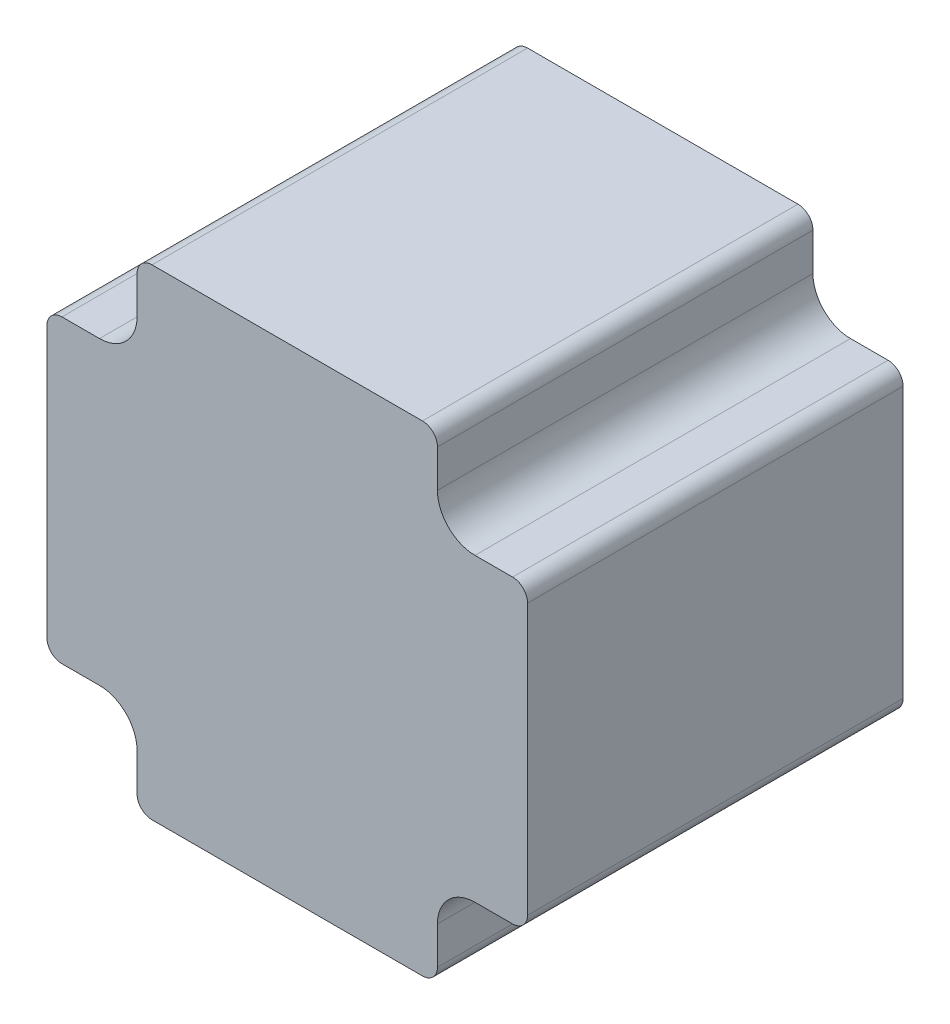
ISO-10303-21;
HEADER;
FILE_DESCRIPTION(('STEP AP214'),'2;1');
FILE_NAME('part.step','',(''),(''),'','','');
FILE_SCHEMA(('AUTOMOTIVE_DESIGN { 1 0 10303 214 1 1 1 1 }'));
ENDSEC;
DATA;
#1=APPLICATION_CONTEXT('core data for automotive mechanical design processes');
#2=APPLICATION_PROTOCOL_DEFINITION('international standard','automotive_design',2000,#1);
#3=PRODUCT_CONTEXT('',#1,'mechanical');
#4=PRODUCT('Part','Part','',(#3));
#5=PRODUCT_RELATED_PRODUCT_CATEGORY('part','',(#4));
#6=PRODUCT_DEFINITION_FORMATION('','',#4);
#7=PRODUCT_DEFINITION_CONTEXT('part definition',#1,'design');
#8=PRODUCT_DEFINITION('design','',#6,#7);
#9=PRODUCT_DEFINITION_SHAPE('','',#8);
#10=(LENGTH_UNIT() NAMED_UNIT(*) SI_UNIT(.MILLI.,.METRE.));
#11=(NAMED_UNIT(*) PLANE_ANGLE_UNIT() SI_UNIT($,.RADIAN.));
#12=(NAMED_UNIT(*) SI_UNIT($,.STERADIAN.) SOLID_ANGLE_UNIT());
#13=UNCERTAINTY_MEASURE_WITH_UNIT(LENGTH_MEASURE(1.E-05),#10,'distance_accuracy_value','');
#14=(GEOMETRIC_REPRESENTATION_CONTEXT(3) GLOBAL_UNCERTAINTY_ASSIGNED_CONTEXT((#13)) GLOBAL_UNIT_ASSIGNED_CONTEXT((#10,
#11,#12)) REPRESENTATION_CONTEXT('',''));
#15=CARTESIAN_POINT('',(0.,0.,0.));
#16=DIRECTION('',(0.,0.,1.));
#17=DIRECTION('',(1.,0.,0.));
#18=AXIS2_PLACEMENT_3D('',#15,#16,#17);
#19=CARTESIAN_POINT('',(0.,0.,-97.75));
#20=DIRECTION('',(0.,0.,-1.));
#21=DIRECTION('',(-1.,0.,0.));
#22=AXIS2_PLACEMENT_3D('',#19,#20,#21);
#23=PLANE('',#22);
#24=DIRECTION('',(0.,1.,0.));
#25=VECTOR('',#24,1.);
#26=CARTESIAN_POINT('',(-15.,15.,-97.75));
#27=LINE('',#26,#25);
#28=CARTESIAN_POINT('',(-15.,22.5,-97.75));
#29=VERTEX_POINT('',#28);
#30=CARTESIAN_POINT('',(-15.,18.75,-97.75));
#31=VERTEX_POINT('',#30);
#32=EDGE_CURVE('E209',#29,#31,#27,.F.);
#33=ORIENTED_EDGE('',*,*,#32,.F.);
#34=CARTESIAN_POINT('',(-13.5,22.5,-97.75));
#35=DIRECTION('',(0.,0.,1.));
#36=DIRECTION('',(1.,0.,0.));
#37=AXIS2_PLACEMENT_3D('',#34,#35,#36);
#38=CIRCLE('',#37,1.5);
#39=CARTESIAN_POINT('',(-13.5,24.,-97.75));
#40=VERTEX_POINT('',#39);
#41=EDGE_CURVE('E41',#40,#29,#38,.T.);
#42=ORIENTED_EDGE('',*,*,#41,.F.);
#43=DIRECTION('',(1.,0.,0.));
#44=VECTOR('',#43,1.);
#45=CARTESIAN_POINT('',(-15.,24.,-97.75));
#46=LINE('',#45,#44);
#47=CARTESIAN_POINT('',(13.5,24.,-97.75));
#48=VERTEX_POINT('',#47);
#49=EDGE_CURVE('E195',#48,#40,#46,.F.);
#50=ORIENTED_EDGE('',*,*,#49,.F.);
#51=CARTESIAN_POINT('',(13.5,22.5,-97.75));
#52=DIRECTION('',(0.,0.,1.));
#53=DIRECTION('',(1.,0.,0.));
#54=AXIS2_PLACEMENT_3D('',#51,#52,#53);
#55=CIRCLE('',#54,1.5);
#56=CARTESIAN_POINT('',(15.,22.5,-97.75));
#57=VERTEX_POINT('',#56);
#58=EDGE_CURVE('E216',#57,#48,#55,.T.);
#59=ORIENTED_EDGE('',*,*,#58,.F.);
#60=DIRECTION('',(0.,1.,0.));
#61=VECTOR('',#60,1.);
#62=CARTESIAN_POINT('',(15.,24.,-97.75));
#63=LINE('',#62,#61);
#64=CARTESIAN_POINT('',(15.,18.75,-97.75));
#65=VERTEX_POINT('',#64);
#66=EDGE_CURVE('E259',#65,#57,#63,.T.);
#67=ORIENTED_EDGE('',*,*,#66,.F.);
#68=CARTESIAN_POINT('',(18.75,18.75,-97.75));
#69=DIRECTION('',(0.,0.,-1.));
#70=DIRECTION('',(-1.,0.,0.));
#71=AXIS2_PLACEMENT_3D('',#68,#69,#70);
#72=CIRCLE('',#71,3.75);
#73=CARTESIAN_POINT('',(18.75,15.,-97.75));
#74=VERTEX_POINT('',#73);
#75=EDGE_CURVE('E258',#65,#74,#72,.F.);
#76=ORIENTED_EDGE('',*,*,#75,.T.);
#77=DIRECTION('',(1.,0.,0.));
#78=VECTOR('',#77,1.);
#79=CARTESIAN_POINT('',(15.,15.,-97.75));
#80=LINE('',#79,#78);
#81=CARTESIAN_POINT('',(22.5,15.,-97.75));
#82=VERTEX_POINT('',#81);
#83=EDGE_CURVE('E255',#82,#74,#80,.F.);
#84=ORIENTED_EDGE('',*,*,#83,.F.);
#85=CARTESIAN_POINT('',(22.5,13.5,-97.75));
#86=DIRECTION('',(0.,0.,1.));
#87=DIRECTION('',(1.,0.,0.));
#88=AXIS2_PLACEMENT_3D('',#85,#86,#87);
#89=CIRCLE('',#88,1.5);
#90=CARTESIAN_POINT('',(24.,13.5,-97.75));
#91=VERTEX_POINT('',#90);
#92=EDGE_CURVE('E325',#91,#82,#89,.T.);
#93=ORIENTED_EDGE('',*,*,#92,.F.);
#94=DIRECTION('',(0.,1.,0.));
#95=VECTOR('',#94,1.);
#96=CARTESIAN_POINT('',(24.,15.,-97.75));
#97=LINE('',#96,#95);
#98=CARTESIAN_POINT('',(24.,-13.5,-97.75));
#99=VERTEX_POINT('',#98);
#100=EDGE_CURVE('E251',#99,#91,#97,.T.);
#101=ORIENTED_EDGE('',*,*,#100,.F.);
#102=CARTESIAN_POINT('',(22.5,-13.5,-97.75));
#103=DIRECTION('',(0.,0.,1.));
#104=DIRECTION('',(1.,0.,0.));
#105=AXIS2_PLACEMENT_3D('',#102,#103,#104);
#106=CIRCLE('',#105,1.5);
#107=CARTESIAN_POINT('',(22.5,-15.,-97.75));
#108=VERTEX_POINT('',#107);
#109=EDGE_CURVE('E323',#108,#99,#106,.T.);
#110=ORIENTED_EDGE('',*,*,#109,.F.);
#111=DIRECTION('',(1.,0.,0.));
#112=VECTOR('',#111,1.);
#113=CARTESIAN_POINT('',(24.,-15.,-97.75));
#114=LINE('',#113,#112);
#115=CARTESIAN_POINT('',(18.75,-15.,-97.75));
#116=VERTEX_POINT('',#115);
#117=EDGE_CURVE('E247',#116,#108,#114,.T.);
#118=ORIENTED_EDGE('',*,*,#117,.F.);
#119=CARTESIAN_POINT('',(18.75,-18.75,-97.75));
#120=DIRECTION('',(0.,0.,-1.));
#121=DIRECTION('',(-1.,0.,0.));
#122=AXIS2_PLACEMENT_3D('',#119,#120,#121);
#123=CIRCLE('',#122,3.75);
#124=CARTESIAN_POINT('',(15.,-18.75,-97.75));
#125=VERTEX_POINT('',#124);
#126=EDGE_CURVE('E246',#116,#125,#123,.F.);
#127=ORIENTED_EDGE('',*,*,#126,.T.);
#128=DIRECTION('',(0.,1.,0.));
#129=VECTOR('',#128,1.);
#130=CARTESIAN_POINT('',(15.,-15.,-97.75));
#131=LINE('',#130,#129);
#132=CARTESIAN_POINT('',(15.,-22.5,-97.75));
#133=VERTEX_POINT('',#132);
#134=EDGE_CURVE('E243',#133,#125,#131,.T.);
#135=ORIENTED_EDGE('',*,*,#134,.F.);
#136=CARTESIAN_POINT('',(13.5,-22.5,-97.75));
#137=DIRECTION('',(0.,0.,1.));
#138=DIRECTION('',(1.,0.,0.));
#139=AXIS2_PLACEMENT_3D('',#136,#137,#138);
#140=CIRCLE('',#139,1.5);
#141=CARTESIAN_POINT('',(13.5,-24.,-97.75));
#142=VERTEX_POINT('',#141);
#143=EDGE_CURVE('E318',#142,#133,#140,.T.);
#144=ORIENTED_EDGE('',*,*,#143,.F.);
#145=DIRECTION('',(1.,0.,0.));
#146=VECTOR('',#145,1.);
#147=CARTESIAN_POINT('',(15.,-24.,-97.75));
#148=LINE('',#147,#146);
#149=CARTESIAN_POINT('',(-13.5,-24.,-97.75));
#150=VERTEX_POINT('',#149);
#151=EDGE_CURVE('E239',#150,#142,#148,.T.);
#152=ORIENTED_EDGE('',*,*,#151,.F.);
#153=CARTESIAN_POINT('',(-13.5,-22.5,-97.75));
#154=DIRECTION('',(0.,0.,1.));
#155=DIRECTION('',(1.,0.,0.));
#156=AXIS2_PLACEMENT_3D('',#153,#154,#155);
#157=CIRCLE('',#156,1.5);
#158=CARTESIAN_POINT('',(-15.,-22.5,-97.75));
#159=VERTEX_POINT('',#158);
#160=EDGE_CURVE('E316',#159,#150,#157,.T.);
#161=ORIENTED_EDGE('',*,*,#160,.F.);
#162=DIRECTION('',(0.,1.,0.));
#163=VECTOR('',#162,1.);
#164=CARTESIAN_POINT('',(-15.,-24.,-97.75));
#165=LINE('',#164,#163);
#166=CARTESIAN_POINT('',(-15.,-18.75,-97.75));
#167=VERTEX_POINT('',#166);
#168=EDGE_CURVE('E235',#167,#159,#165,.F.);
#169=ORIENTED_EDGE('',*,*,#168,.F.);
#170=CARTESIAN_POINT('',(-18.75,-18.75,-97.75));
#171=DIRECTION('',(0.,0.,-1.));
#172=DIRECTION('',(-1.,0.,0.));
#173=AXIS2_PLACEMENT_3D('',#170,#171,#172);
#174=CIRCLE('',#173,3.75);
#175=CARTESIAN_POINT('',(-18.75,-15.,-97.75));
#176=VERTEX_POINT('',#175);
#177=EDGE_CURVE('E234',#167,#176,#174,.F.);
#178=ORIENTED_EDGE('',*,*,#177,.T.);
#179=DIRECTION('',(1.,0.,0.));
#180=VECTOR('',#179,1.);
#181=CARTESIAN_POINT('',(-15.,-15.,-97.75));
#182=LINE('',#181,#180);
#183=CARTESIAN_POINT('',(-22.5,-15.,-97.75));
#184=VERTEX_POINT('',#183);
#185=EDGE_CURVE('E231',#184,#176,#182,.T.);
#186=ORIENTED_EDGE('',*,*,#185,.F.);
#187=CARTESIAN_POINT('',(-22.5,-13.5,-97.75));
#188=DIRECTION('',(0.,0.,1.));
#189=DIRECTION('',(1.,0.,0.));
#190=AXIS2_PLACEMENT_3D('',#187,#188,#189);
#191=CIRCLE('',#190,1.5);
#192=CARTESIAN_POINT('',(-24.,-13.5,-97.75));
#193=VERTEX_POINT('',#192);
#194=EDGE_CURVE('E311',#193,#184,#191,.T.);
#195=ORIENTED_EDGE('',*,*,#194,.F.);
#196=DIRECTION('',(0.,1.,0.));
#197=VECTOR('',#196,1.);
#198=CARTESIAN_POINT('',(-24.,-15.,-97.75));
#199=LINE('',#198,#197);
#200=CARTESIAN_POINT('',(-24.,13.5,-97.75));
#201=VERTEX_POINT('',#200);
#202=EDGE_CURVE('E227',#201,#193,#199,.F.);
#203=ORIENTED_EDGE('',*,*,#202,.F.);
#204=CARTESIAN_POINT('',(-22.5,13.5,-97.75));
#205=DIRECTION('',(0.,0.,1.));
#206=DIRECTION('',(1.,0.,0.));
#207=AXIS2_PLACEMENT_3D('',#204,#205,#206);
#208=CIRCLE('',#207,1.5);
#209=CARTESIAN_POINT('',(-22.5,15.,-97.75));
#210=VERTEX_POINT('',#209);
#211=EDGE_CURVE('E309',#210,#201,#208,.T.);
#212=ORIENTED_EDGE('',*,*,#211,.F.);
#213=DIRECTION('',(1.,0.,0.));
#214=VECTOR('',#213,1.);
#215=CARTESIAN_POINT('',(-24.,15.,-97.75));
#216=LINE('',#215,#214);
#217=CARTESIAN_POINT('',(-18.75,15.,-97.75));
#218=VERTEX_POINT('',#217);
#219=EDGE_CURVE('E223',#218,#210,#216,.F.);
#220=ORIENTED_EDGE('',*,*,#219,.F.);
#221=CARTESIAN_POINT('',(-18.75,18.75,-97.75));
#222=DIRECTION('',(0.,0.,-1.));
#223=DIRECTION('',(-1.,0.,0.));
#224=AXIS2_PLACEMENT_3D('',#221,#222,#223);
#225=CIRCLE('',#224,3.75);
#226=EDGE_CURVE('E222',#218,#31,#225,.F.);
#227=ORIENTED_EDGE('',*,*,#226,.T.);
#228=EDGE_LOOP('',(#33,#42,#50,#59,#67,#76,#84,#93,#101,#110,#118,#127,#135,#144,#152,#161,#169,
#178,#186,#195,#203,#212,#220,#227));
#229=FACE_BOUND('',#228,.T.);
#230=ADVANCED_FACE('F38',(#229),#23,.T.);
#231=CARTESIAN_POINT('',(-13.5,22.5,-97.813077794458));
#232=DIRECTION('',(0.,0.,1.));
#233=DIRECTION('',(1.,0.,0.));
#234=AXIS2_PLACEMENT_3D('',#231,#232,#233);
#235=CYLINDRICAL_SURFACE('',#234,1.5);
#236=DIRECTION('',(0.,0.,1.));
#237=VECTOR('',#236,1.);
#238=CARTESIAN_POINT('',(-15.,22.5,-97.75));
#239=LINE('',#238,#237);
#240=CARTESIAN_POINT('',(-15.,22.5,-60.25));
#241=VERTEX_POINT('',#240);
#242=EDGE_CURVE('E306',#241,#29,#239,.F.);
#243=ORIENTED_EDGE('',*,*,#242,.F.);
#244=CARTESIAN_POINT('',(-13.5,22.5,-60.25));
#245=DIRECTION('',(0.,0.,1.));
#246=DIRECTION('',(1.,0.,0.));
#247=AXIS2_PLACEMENT_3D('',#244,#245,#246);
#248=CIRCLE('',#247,1.5);
#249=CARTESIAN_POINT('',(-13.5,24.,-60.25));
#250=VERTEX_POINT('',#249);
#251=EDGE_CURVE('E215',#241,#250,#248,.F.);
#252=ORIENTED_EDGE('',*,*,#251,.T.);
#253=DIRECTION('',(0.,0.,1.));
#254=VECTOR('',#253,1.);
#255=CARTESIAN_POINT('',(-13.5,24.,-97.75));
#256=LINE('',#255,#254);
#257=EDGE_CURVE('E200',#40,#250,#256,.T.);
#258=ORIENTED_EDGE('',*,*,#257,.F.);
#259=ORIENTED_EDGE('',*,*,#41,.T.);
#260=EDGE_LOOP('',(#243,#252,#258,#259));
#261=FACE_BOUND('',#260,.T.);
#262=ADVANCED_FACE('F214',(#261),#235,.T.);
#263=CARTESIAN_POINT('',(-15.,24.,-97.75));
#264=DIRECTION('',(0.,1.,0.));
#265=DIRECTION('',(0.,0.,1.));
#266=AXIS2_PLACEMENT_3D('',#263,#264,#265);
#267=PLANE('',#266);
#268=ORIENTED_EDGE('',*,*,#49,.T.);
#269=ORIENTED_EDGE('',*,*,#257,.T.);
#270=DIRECTION('',(-1.,0.,0.));
#271=VECTOR('',#270,1.);
#272=CARTESIAN_POINT('',(0.,24.,-60.25));
#273=LINE('',#272,#271);
#274=CARTESIAN_POINT('',(13.5,24.,-60.25));
#275=VERTEX_POINT('',#274);
#276=EDGE_CURVE('E304',#250,#275,#273,.F.);
#277=ORIENTED_EDGE('',*,*,#276,.T.);
#278=DIRECTION('',(0.,0.,1.));
#279=VECTOR('',#278,1.);
#280=CARTESIAN_POINT('',(13.5,24.,-97.813077794458));
#281=LINE('',#280,#279);
#282=EDGE_CURVE('E202',#48,#275,#281,.T.);
#283=ORIENTED_EDGE('',*,*,#282,.F.);
#284=EDGE_LOOP('',(#268,#269,#277,#283));
#285=FACE_BOUND('',#284,.T.);
#286=ADVANCED_FACE('F197',(#285),#267,.T.);
#287=CARTESIAN_POINT('',(13.5,22.5,-97.813077794458));
#288=DIRECTION('',(0.,0.,1.));
#289=DIRECTION('',(1.,0.,0.));
#290=AXIS2_PLACEMENT_3D('',#287,#288,#289);
#291=CYLINDRICAL_SURFACE('',#290,1.5);
#292=ORIENTED_EDGE('',*,*,#282,.T.);
#293=CARTESIAN_POINT('',(13.5,22.5,-60.25));
#294=DIRECTION('',(0.,0.,1.));
#295=DIRECTION('',(1.,0.,0.));
#296=AXIS2_PLACEMENT_3D('',#293,#294,#295);
#297=CIRCLE('',#296,1.5);
#298=CARTESIAN_POINT('',(15.,22.5,-60.25));
#299=VERTEX_POINT('',#298);
#300=EDGE_CURVE('E301',#275,#299,#297,.F.);
#301=ORIENTED_EDGE('',*,*,#300,.T.);
#302=DIRECTION('',(0.,0.,-1.));
#303=VECTOR('',#302,1.);
#304=CARTESIAN_POINT('',(15.,22.5,-97.75));
#305=LINE('',#304,#303);
#306=EDGE_CURVE('E260',#57,#299,#305,.F.);
#307=ORIENTED_EDGE('',*,*,#306,.F.);
#308=ORIENTED_EDGE('',*,*,#58,.T.);
#309=EDGE_LOOP('',(#292,#301,#307,#308));
#310=FACE_BOUND('',#309,.T.);
#311=ADVANCED_FACE('F472',(#310),#291,.T.);
#312=CARTESIAN_POINT('',(15.,24.,-97.75));
#313=DIRECTION('',(1.,0.,0.));
#314=DIRECTION('',(0.,0.,-1.));
#315=AXIS2_PLACEMENT_3D('',#312,#313,#314);
#316=PLANE('',#315);
#317=ORIENTED_EDGE('',*,*,#66,.T.);
#318=ORIENTED_EDGE('',*,*,#306,.T.);
#319=DIRECTION('',(0.,1.,0.));
#320=VECTOR('',#319,1.);
#321=CARTESIAN_POINT('',(15.,0.,-60.25));
#322=LINE('',#321,#320);
#323=CARTESIAN_POINT('',(15.,18.75,-60.25));
#324=VERTEX_POINT('',#323);
#325=EDGE_CURVE('E300',#299,#324,#322,.F.);
#326=ORIENTED_EDGE('',*,*,#325,.T.);
#327=DIRECTION('',(0.,0.,-1.));
#328=VECTOR('',#327,1.);
#329=CARTESIAN_POINT('',(15.,18.75,-60.19610331397));
#330=LINE('',#329,#328);
#331=EDGE_CURVE('E328',#324,#65,#330,.T.);
#332=ORIENTED_EDGE('',*,*,#331,.T.);
#333=EDGE_LOOP('',(#317,#318,#326,#332));
#334=FACE_BOUND('',#333,.T.);
#335=ADVANCED_FACE('F465',(#334),#316,.T.);
#336=CARTESIAN_POINT('',(18.75,18.75,-60.19610331397));
#337=DIRECTION('',(0.,0.,-1.));
#338=DIRECTION('',(-1.,0.,0.));
#339=AXIS2_PLACEMENT_3D('',#336,#337,#338);
#340=CYLINDRICAL_SURFACE('',#339,3.75);
#341=ORIENTED_EDGE('',*,*,#331,.F.);
#342=CARTESIAN_POINT('',(18.75,18.75,-60.25));
#343=DIRECTION('',(0.,0.,-1.));
#344=DIRECTION('',(-1.,0.,0.));
#345=AXIS2_PLACEMENT_3D('',#342,#343,#344);
#346=CIRCLE('',#345,3.75);
#347=CARTESIAN_POINT('',(18.75,15.,-60.25));
#348=VERTEX_POINT('',#347);
#349=EDGE_CURVE('E297',#324,#348,#346,.F.);
#350=ORIENTED_EDGE('',*,*,#349,.T.);
#351=DIRECTION('',(0.,0.,1.));
#352=VECTOR('',#351,1.);
#353=CARTESIAN_POINT('',(18.75,15.,-97.75));
#354=LINE('',#353,#352);
#355=EDGE_CURVE('E257',#74,#348,#354,.T.);
#356=ORIENTED_EDGE('',*,*,#355,.F.);
#357=ORIENTED_EDGE('',*,*,#75,.F.);
#358=EDGE_LOOP('',(#341,#350,#356,#357));
#359=FACE_BOUND('',#358,.T.);
#360=ADVANCED_FACE('F463',(#359),#340,.F.);
#361=CARTESIAN_POINT('',(15.,15.,-97.75));
#362=DIRECTION('',(0.,1.,0.));
#363=DIRECTION('',(0.,0.,1.));
#364=AXIS2_PLACEMENT_3D('',#361,#362,#363);
#365=PLANE('',#364);
#366=DIRECTION('',(-1.,0.,0.));
#367=VECTOR('',#366,1.);
#368=CARTESIAN_POINT('',(0.,15.,-60.25));
#369=LINE('',#368,#367);
#370=CARTESIAN_POINT('',(22.5,15.,-60.25));
#371=VERTEX_POINT('',#370);
#372=EDGE_CURVE('E296',#348,#371,#369,.F.);
#373=ORIENTED_EDGE('',*,*,#372,.T.);
#374=DIRECTION('',(0.,0.,1.));
#375=VECTOR('',#374,1.);
#376=CARTESIAN_POINT('',(22.5,15.,-97.813077794458));
#377=LINE('',#376,#375);
#378=EDGE_CURVE('E254',#82,#371,#377,.T.);
#379=ORIENTED_EDGE('',*,*,#378,.F.);
#380=ORIENTED_EDGE('',*,*,#83,.T.);
#381=ORIENTED_EDGE('',*,*,#355,.T.);
#382=EDGE_LOOP('',(#373,#379,#380,#381));
#383=FACE_BOUND('',#382,.T.);
#384=ADVANCED_FACE('F459',(#383),#365,.T.);
#385=CARTESIAN_POINT('',(22.5,13.5,-97.813077794458));
#386=DIRECTION('',(0.,0.,1.));
#387=DIRECTION('',(1.,0.,0.));
#388=AXIS2_PLACEMENT_3D('',#385,#386,#387);
#389=CYLINDRICAL_SURFACE('',#388,1.5);
#390=ORIENTED_EDGE('',*,*,#378,.T.);
#391=CARTESIAN_POINT('',(22.5,13.5,-60.25));
#392=DIRECTION('',(0.,0.,1.));
#393=DIRECTION('',(1.,0.,0.));
#394=AXIS2_PLACEMENT_3D('',#391,#392,#393);
#395=CIRCLE('',#394,1.5);
#396=CARTESIAN_POINT('',(24.,13.5,-60.25));
#397=VERTEX_POINT('',#396);
#398=EDGE_CURVE('E293',#371,#397,#395,.F.);
#399=ORIENTED_EDGE('',*,*,#398,.T.);
#400=DIRECTION('',(0.,0.,-1.));
#401=VECTOR('',#400,1.);
#402=CARTESIAN_POINT('',(24.,13.5,-97.75));
#403=LINE('',#402,#401);
#404=EDGE_CURVE('E253',#91,#397,#403,.F.);
#405=ORIENTED_EDGE('',*,*,#404,.F.);
#406=ORIENTED_EDGE('',*,*,#92,.T.);
#407=EDGE_LOOP('',(#390,#399,#405,#406));
#408=FACE_BOUND('',#407,.T.);
#409=ADVANCED_FACE('F456',(#408),#389,.T.);
#410=CARTESIAN_POINT('',(24.,15.,-97.75));
#411=DIRECTION('',(1.,0.,0.));
#412=DIRECTION('',(0.,0.,-1.));
#413=AXIS2_PLACEMENT_3D('',#410,#411,#412);
#414=PLANE('',#413);
#415=DIRECTION('',(0.,1.,0.));
#416=VECTOR('',#415,1.);
#417=CARTESIAN_POINT('',(24.,0.,-60.25));
#418=LINE('',#417,#416);
#419=CARTESIAN_POINT('',(24.,-13.5,-60.25));
#420=VERTEX_POINT('',#419);
#421=EDGE_CURVE('E292',#397,#420,#418,.F.);
#422=ORIENTED_EDGE('',*,*,#421,.T.);
#423=DIRECTION('',(0.,0.,1.));
#424=VECTOR('',#423,1.);
#425=CARTESIAN_POINT('',(24.,-13.5,-97.813077794458));
#426=LINE('',#425,#424);
#427=EDGE_CURVE('E250',#99,#420,#426,.T.);
#428=ORIENTED_EDGE('',*,*,#427,.F.);
#429=ORIENTED_EDGE('',*,*,#100,.T.);
#430=ORIENTED_EDGE('',*,*,#404,.T.);
#431=EDGE_LOOP('',(#422,#428,#429,#430));
#432=FACE_BOUND('',#431,.T.);
#433=ADVANCED_FACE('F450',(#432),#414,.T.);
#434=CARTESIAN_POINT('',(22.5,-13.5,-97.813077794458));
#435=DIRECTION('',(0.,0.,1.));
#436=DIRECTION('',(1.,0.,0.));
#437=AXIS2_PLACEMENT_3D('',#434,#435,#436);
#438=CYLINDRICAL_SURFACE('',#437,1.5);
#439=ORIENTED_EDGE('',*,*,#427,.T.);
#440=CARTESIAN_POINT('',(22.5,-13.5,-60.25));
#441=DIRECTION('',(0.,0.,1.));
#442=DIRECTION('',(1.,0.,0.));
#443=AXIS2_PLACEMENT_3D('',#440,#441,#442);
#444=CIRCLE('',#443,1.5);
#445=CARTESIAN_POINT('',(22.5,-15.,-60.25));
#446=VERTEX_POINT('',#445);
#447=EDGE_CURVE('E289',#420,#446,#444,.F.);
#448=ORIENTED_EDGE('',*,*,#447,.T.);
#449=DIRECTION('',(0.,0.,-1.));
#450=VECTOR('',#449,1.);
#451=CARTESIAN_POINT('',(22.5,-15.,-97.75));
#452=LINE('',#451,#450);
#453=EDGE_CURVE('E249',#108,#446,#452,.F.);
#454=ORIENTED_EDGE('',*,*,#453,.F.);
#455=ORIENTED_EDGE('',*,*,#109,.T.);
#456=EDGE_LOOP('',(#439,#448,#454,#455));
#457=FACE_BOUND('',#456,.T.);
#458=ADVANCED_FACE('F446',(#457),#438,.T.);
#459=CARTESIAN_POINT('',(24.,-15.,-97.75));
#460=DIRECTION('',(0.,-1.,0.));
#461=DIRECTION('',(0.,0.,-1.));
#462=AXIS2_PLACEMENT_3D('',#459,#460,#461);
#463=PLANE('',#462);
#464=ORIENTED_EDGE('',*,*,#117,.T.);
#465=ORIENTED_EDGE('',*,*,#453,.T.);
#466=DIRECTION('',(-1.,0.,0.));
#467=VECTOR('',#466,1.);
#468=CARTESIAN_POINT('',(0.,-15.,-60.25));
#469=LINE('',#468,#467);
#470=CARTESIAN_POINT('',(18.75,-15.,-60.25));
#471=VERTEX_POINT('',#470);
#472=EDGE_CURVE('E288',#446,#471,#469,.T.);
#473=ORIENTED_EDGE('',*,*,#472,.T.);
#474=DIRECTION('',(0.,0.,-1.));
#475=VECTOR('',#474,1.);
#476=CARTESIAN_POINT('',(18.75,-15.,-60.19610331397));
#477=LINE('',#476,#475);
#478=EDGE_CURVE('E322',#471,#116,#477,.T.);
#479=ORIENTED_EDGE('',*,*,#478,.T.);
#480=EDGE_LOOP('',(#464,#465,#473,#479));
#481=FACE_BOUND('',#480,.T.);
#482=ADVANCED_FACE('F440',(#481),#463,.T.);
#483=CARTESIAN_POINT('',(18.75,-18.75,-60.19610331397));
#484=DIRECTION('',(0.,0.,-1.));
#485=DIRECTION('',(-1.,0.,0.));
#486=AXIS2_PLACEMENT_3D('',#483,#484,#485);
#487=CYLINDRICAL_SURFACE('',#486,3.75);
#488=ORIENTED_EDGE('',*,*,#478,.F.);
#489=CARTESIAN_POINT('',(18.75,-18.75,-60.25));
#490=DIRECTION('',(0.,0.,-1.));
#491=DIRECTION('',(-1.,0.,0.));
#492=AXIS2_PLACEMENT_3D('',#489,#490,#491);
#493=CIRCLE('',#492,3.75);
#494=CARTESIAN_POINT('',(15.,-18.75,-60.25));
#495=VERTEX_POINT('',#494);
#496=EDGE_CURVE('E285',#471,#495,#493,.F.);
#497=ORIENTED_EDGE('',*,*,#496,.T.);
#498=DIRECTION('',(0.,0.,-1.));
#499=VECTOR('',#498,1.);
#500=CARTESIAN_POINT('',(15.,-18.75,-97.75));
#501=LINE('',#500,#499);
#502=EDGE_CURVE('E245',#125,#495,#501,.F.);
#503=ORIENTED_EDGE('',*,*,#502,.F.);
#504=ORIENTED_EDGE('',*,*,#126,.F.);
#505=EDGE_LOOP('',(#488,#497,#503,#504));
#506=FACE_BOUND('',#505,.T.);
#507=ADVANCED_FACE('F437',(#506),#487,.F.);
#508=CARTESIAN_POINT('',(15.,-15.,-97.75));
#509=DIRECTION('',(1.,0.,0.));
#510=DIRECTION('',(0.,0.,-1.));
#511=AXIS2_PLACEMENT_3D('',#508,#509,#510);
#512=PLANE('',#511);
#513=DIRECTION('',(0.,1.,0.));
#514=VECTOR('',#513,1.);
#515=CARTESIAN_POINT('',(15.,0.,-60.25));
#516=LINE('',#515,#514);
#517=CARTESIAN_POINT('',(15.,-22.5,-60.25));
#518=VERTEX_POINT('',#517);
#519=EDGE_CURVE('E284',#495,#518,#516,.F.);
#520=ORIENTED_EDGE('',*,*,#519,.T.);
#521=DIRECTION('',(0.,0.,1.));
#522=VECTOR('',#521,1.);
#523=CARTESIAN_POINT('',(15.,-22.5,-97.813077794458));
#524=LINE('',#523,#522);
#525=EDGE_CURVE('E242',#133,#518,#524,.T.);
#526=ORIENTED_EDGE('',*,*,#525,.F.);
#527=ORIENTED_EDGE('',*,*,#134,.T.);
#528=ORIENTED_EDGE('',*,*,#502,.T.);
#529=EDGE_LOOP('',(#520,#526,#527,#528));
#530=FACE_BOUND('',#529,.T.);
#531=ADVANCED_FACE('F432',(#530),#512,.T.);
#532=CARTESIAN_POINT('',(13.5,-22.5,-97.813077794458));
#533=DIRECTION('',(0.,0.,1.));
#534=DIRECTION('',(1.,0.,0.));
#535=AXIS2_PLACEMENT_3D('',#532,#533,#534);
#536=CYLINDRICAL_SURFACE('',#535,1.5);
#537=ORIENTED_EDGE('',*,*,#525,.T.);
#538=CARTESIAN_POINT('',(13.5,-22.5,-60.25));
#539=DIRECTION('',(0.,0.,1.));
#540=DIRECTION('',(1.,0.,0.));
#541=AXIS2_PLACEMENT_3D('',#538,#539,#540);
#542=CIRCLE('',#541,1.5);
#543=CARTESIAN_POINT('',(13.5,-24.,-60.25));
#544=VERTEX_POINT('',#543);
#545=EDGE_CURVE('E281',#518,#544,#542,.F.);
#546=ORIENTED_EDGE('',*,*,#545,.T.);
#547=DIRECTION('',(0.,0.,-1.));
#548=VECTOR('',#547,1.);
#549=CARTESIAN_POINT('',(13.5,-24.,-97.75));
#550=LINE('',#549,#548);
#551=EDGE_CURVE('E241',#142,#544,#550,.F.);
#552=ORIENTED_EDGE('',*,*,#551,.F.);
#553=ORIENTED_EDGE('',*,*,#143,.T.);
#554=EDGE_LOOP('',(#537,#546,#552,#553));
#555=FACE_BOUND('',#554,.T.);
#556=ADVANCED_FACE('F428',(#555),#536,.T.);
#557=CARTESIAN_POINT('',(15.,-24.,-97.75));
#558=DIRECTION('',(0.,-1.,0.));
#559=DIRECTION('',(0.,0.,-1.));
#560=AXIS2_PLACEMENT_3D('',#557,#558,#559);
#561=PLANE('',#560);
#562=DIRECTION('',(-1.,0.,0.));
#563=VECTOR('',#562,1.);
#564=CARTESIAN_POINT('',(0.,-24.,-60.25));
#565=LINE('',#564,#563);
#566=CARTESIAN_POINT('',(-13.5,-24.,-60.25));
#567=VERTEX_POINT('',#566);
#568=EDGE_CURVE('E280',#544,#567,#565,.T.);
#569=ORIENTED_EDGE('',*,*,#568,.T.);
#570=DIRECTION('',(0.,0.,1.));
#571=VECTOR('',#570,1.);
#572=CARTESIAN_POINT('',(-13.5,-24.,-97.813077794458));
#573=LINE('',#572,#571);
#574=EDGE_CURVE('E238',#150,#567,#573,.T.);
#575=ORIENTED_EDGE('',*,*,#574,.F.);
#576=ORIENTED_EDGE('',*,*,#151,.T.);
#577=ORIENTED_EDGE('',*,*,#551,.T.);
#578=EDGE_LOOP('',(#569,#575,#576,#577));
#579=FACE_BOUND('',#578,.T.);
#580=ADVANCED_FACE('F422',(#579),#561,.T.);
#581=CARTESIAN_POINT('',(-13.5,-22.5,-97.813077794458));
#582=DIRECTION('',(0.,0.,1.));
#583=DIRECTION('',(1.,0.,0.));
#584=AXIS2_PLACEMENT_3D('',#581,#582,#583);
#585=CYLINDRICAL_SURFACE('',#584,1.5);
#586=ORIENTED_EDGE('',*,*,#574,.T.);
#587=CARTESIAN_POINT('',(-13.5,-22.5,-60.25));
#588=DIRECTION('',(0.,0.,1.));
#589=DIRECTION('',(1.,0.,0.));
#590=AXIS2_PLACEMENT_3D('',#587,#588,#589);
#591=CIRCLE('',#590,1.5);
#592=CARTESIAN_POINT('',(-15.,-22.5,-60.25));
#593=VERTEX_POINT('',#592);
#594=EDGE_CURVE('E277',#567,#593,#591,.F.);
#595=ORIENTED_EDGE('',*,*,#594,.T.);
#596=DIRECTION('',(0.,0.,1.));
#597=VECTOR('',#596,1.);
#598=CARTESIAN_POINT('',(-15.,-22.5,-97.75));
#599=LINE('',#598,#597);
#600=EDGE_CURVE('E237',#159,#593,#599,.T.);
#601=ORIENTED_EDGE('',*,*,#600,.F.);
#602=ORIENTED_EDGE('',*,*,#160,.T.);
#603=EDGE_LOOP('',(#586,#595,#601,#602));
#604=FACE_BOUND('',#603,.T.);
#605=ADVANCED_FACE('F418',(#604),#585,.T.);
#606=CARTESIAN_POINT('',(-15.,-24.,-97.75));
#607=DIRECTION('',(-1.,0.,0.));
#608=DIRECTION('',(0.,0.,1.));
#609=AXIS2_PLACEMENT_3D('',#606,#607,#608);
#610=PLANE('',#609);
#611=ORIENTED_EDGE('',*,*,#168,.T.);
#612=ORIENTED_EDGE('',*,*,#600,.T.);
#613=DIRECTION('',(0.,1.,0.));
#614=VECTOR('',#613,1.);
#615=CARTESIAN_POINT('',(-15.,0.,-60.25));
#616=LINE('',#615,#614);
#617=CARTESIAN_POINT('',(-15.,-18.75,-60.25));
#618=VERTEX_POINT('',#617);
#619=EDGE_CURVE('E276',#593,#618,#616,.T.);
#620=ORIENTED_EDGE('',*,*,#619,.T.);
#621=DIRECTION('',(0.,0.,-1.));
#622=VECTOR('',#621,1.);
#623=CARTESIAN_POINT('',(-15.,-18.75,-60.19610331397));
#624=LINE('',#623,#622);
#625=EDGE_CURVE('E315',#618,#167,#624,.T.);
#626=ORIENTED_EDGE('',*,*,#625,.T.);
#627=EDGE_LOOP('',(#611,#612,#620,#626));
#628=FACE_BOUND('',#627,.T.);
#629=ADVANCED_FACE('F412',(#628),#610,.T.);
#630=CARTESIAN_POINT('',(-18.75,-18.75,-60.19610331397));
#631=DIRECTION('',(0.,0.,-1.));
#632=DIRECTION('',(-1.,0.,0.));
#633=AXIS2_PLACEMENT_3D('',#630,#631,#632);
#634=CYLINDRICAL_SURFACE('',#633,3.75);
#635=ORIENTED_EDGE('',*,*,#625,.F.);
#636=CARTESIAN_POINT('',(-18.75,-18.75,-60.25));
#637=DIRECTION('',(0.,0.,-1.));
#638=DIRECTION('',(-1.,0.,0.));
#639=AXIS2_PLACEMENT_3D('',#636,#637,#638);
#640=CIRCLE('',#639,3.75);
#641=CARTESIAN_POINT('',(-18.75,-15.,-60.25));
#642=VERTEX_POINT('',#641);
#643=EDGE_CURVE('E273',#618,#642,#640,.F.);
#644=ORIENTED_EDGE('',*,*,#643,.T.);
#645=DIRECTION('',(0.,0.,-1.));
#646=VECTOR('',#645,1.);
#647=CARTESIAN_POINT('',(-18.75,-15.,-97.75));
#648=LINE('',#647,#646);
#649=EDGE_CURVE('E233',#176,#642,#648,.F.);
#650=ORIENTED_EDGE('',*,*,#649,.F.);
#651=ORIENTED_EDGE('',*,*,#177,.F.);
#652=EDGE_LOOP('',(#635,#644,#650,#651));
#653=FACE_BOUND('',#652,.T.);
#654=ADVANCED_FACE('F409',(#653),#634,.F.);
#655=CARTESIAN_POINT('',(-15.,-15.,-97.75));
#656=DIRECTION('',(0.,-1.,0.));
#657=DIRECTION('',(0.,0.,-1.));
#658=AXIS2_PLACEMENT_3D('',#655,#656,#657);
#659=PLANE('',#658);
#660=DIRECTION('',(-1.,0.,0.));
#661=VECTOR('',#660,1.);
#662=CARTESIAN_POINT('',(0.,-15.,-60.25));
#663=LINE('',#662,#661);
#664=CARTESIAN_POINT('',(-22.5,-15.,-60.25));
#665=VERTEX_POINT('',#664);
#666=EDGE_CURVE('E272',#642,#665,#663,.T.);
#667=ORIENTED_EDGE('',*,*,#666,.T.);
#668=DIRECTION('',(0.,0.,1.));
#669=VECTOR('',#668,1.);
#670=CARTESIAN_POINT('',(-22.5,-15.,-97.813077794458));
#671=LINE('',#670,#669);
#672=EDGE_CURVE('E230',#184,#665,#671,.T.);
#673=ORIENTED_EDGE('',*,*,#672,.F.);
#674=ORIENTED_EDGE('',*,*,#185,.T.);
#675=ORIENTED_EDGE('',*,*,#649,.T.);
#676=EDGE_LOOP('',(#667,#673,#674,#675));
#677=FACE_BOUND('',#676,.T.);
#678=ADVANCED_FACE('F404',(#677),#659,.T.);
#679=CARTESIAN_POINT('',(-22.5,-13.5,-97.813077794458));
#680=DIRECTION('',(0.,0.,1.));
#681=DIRECTION('',(1.,0.,0.));
#682=AXIS2_PLACEMENT_3D('',#679,#680,#681);
#683=CYLINDRICAL_SURFACE('',#682,1.5);
#684=ORIENTED_EDGE('',*,*,#672,.T.);
#685=CARTESIAN_POINT('',(-22.5,-13.5,-60.25));
#686=DIRECTION('',(0.,0.,1.));
#687=DIRECTION('',(1.,0.,0.));
#688=AXIS2_PLACEMENT_3D('',#685,#686,#687);
#689=CIRCLE('',#688,1.5);
#690=CARTESIAN_POINT('',(-24.,-13.5,-60.25));
#691=VERTEX_POINT('',#690);
#692=EDGE_CURVE('E269',#665,#691,#689,.F.);
#693=ORIENTED_EDGE('',*,*,#692,.T.);
#694=DIRECTION('',(0.,0.,1.));
#695=VECTOR('',#694,1.);
#696=CARTESIAN_POINT('',(-24.,-13.5,-97.75));
#697=LINE('',#696,#695);
#698=EDGE_CURVE('E229',#193,#691,#697,.T.);
#699=ORIENTED_EDGE('',*,*,#698,.F.);
#700=ORIENTED_EDGE('',*,*,#194,.T.);
#701=EDGE_LOOP('',(#684,#693,#699,#700));
#702=FACE_BOUND('',#701,.T.);
#703=ADVANCED_FACE('F400',(#702),#683,.T.);
#704=CARTESIAN_POINT('',(-24.,-15.,-97.75));
#705=DIRECTION('',(-1.,0.,0.));
#706=DIRECTION('',(0.,0.,1.));
#707=AXIS2_PLACEMENT_3D('',#704,#705,#706);
#708=PLANE('',#707);
#709=DIRECTION('',(0.,1.,0.));
#710=VECTOR('',#709,1.);
#711=CARTESIAN_POINT('',(-24.,0.,-60.25));
#712=LINE('',#711,#710);
#713=CARTESIAN_POINT('',(-24.,13.5,-60.25));
#714=VERTEX_POINT('',#713);
#715=EDGE_CURVE('E268',#691,#714,#712,.T.);
#716=ORIENTED_EDGE('',*,*,#715,.T.);
#717=DIRECTION('',(0.,0.,1.));
#718=VECTOR('',#717,1.);
#719=CARTESIAN_POINT('',(-24.,13.5,-97.813077794458));
#720=LINE('',#719,#718);
#721=EDGE_CURVE('E226',#201,#714,#720,.T.);
#722=ORIENTED_EDGE('',*,*,#721,.F.);
#723=ORIENTED_EDGE('',*,*,#202,.T.);
#724=ORIENTED_EDGE('',*,*,#698,.T.);
#725=EDGE_LOOP('',(#716,#722,#723,#724));
#726=FACE_BOUND('',#725,.T.);
#727=ADVANCED_FACE('F394',(#726),#708,.T.);
#728=CARTESIAN_POINT('',(-22.5,13.5,-97.813077794458));
#729=DIRECTION('',(0.,0.,1.));
#730=DIRECTION('',(1.,0.,0.));
#731=AXIS2_PLACEMENT_3D('',#728,#729,#730);
#732=CYLINDRICAL_SURFACE('',#731,1.5);
#733=ORIENTED_EDGE('',*,*,#721,.T.);
#734=CARTESIAN_POINT('',(-22.5,13.5,-60.25));
#735=DIRECTION('',(0.,0.,1.));
#736=DIRECTION('',(1.,0.,0.));
#737=AXIS2_PLACEMENT_3D('',#734,#735,#736);
#738=CIRCLE('',#737,1.5);
#739=CARTESIAN_POINT('',(-22.5,15.,-60.25));
#740=VERTEX_POINT('',#739);
#741=EDGE_CURVE('E265',#714,#740,#738,.F.);
#742=ORIENTED_EDGE('',*,*,#741,.T.);
#743=DIRECTION('',(0.,0.,1.));
#744=VECTOR('',#743,1.);
#745=CARTESIAN_POINT('',(-22.5,15.,-97.75));
#746=LINE('',#745,#744);
#747=EDGE_CURVE('E225',#210,#740,#746,.T.);
#748=ORIENTED_EDGE('',*,*,#747,.F.);
#749=ORIENTED_EDGE('',*,*,#211,.T.);
#750=EDGE_LOOP('',(#733,#742,#748,#749));
#751=FACE_BOUND('',#750,.T.);
#752=ADVANCED_FACE('F389',(#751),#732,.T.);
#753=CARTESIAN_POINT('',(-24.,15.,-97.75));
#754=DIRECTION('',(0.,1.,0.));
#755=DIRECTION('',(0.,0.,1.));
#756=AXIS2_PLACEMENT_3D('',#753,#754,#755);
#757=PLANE('',#756);
#758=ORIENTED_EDGE('',*,*,#219,.T.);
#759=ORIENTED_EDGE('',*,*,#747,.T.);
#760=DIRECTION('',(-1.,0.,0.));
#761=VECTOR('',#760,1.);
#762=CARTESIAN_POINT('',(0.,15.,-60.25));
#763=LINE('',#762,#761);
#764=CARTESIAN_POINT('',(-18.75,15.,-60.25));
#765=VERTEX_POINT('',#764);
#766=EDGE_CURVE('E264',#740,#765,#763,.F.);
#767=ORIENTED_EDGE('',*,*,#766,.T.);
#768=DIRECTION('',(0.,0.,-1.));
#769=VECTOR('',#768,1.);
#770=CARTESIAN_POINT('',(-18.75,15.,-60.19610331397));
#771=LINE('',#770,#769);
#772=EDGE_CURVE('E308',#765,#218,#771,.T.);
#773=ORIENTED_EDGE('',*,*,#772,.T.);
#774=EDGE_LOOP('',(#758,#759,#767,#773));
#775=FACE_BOUND('',#774,.T.);
#776=ADVANCED_FACE('F381',(#775),#757,.T.);
#777=CARTESIAN_POINT('',(-18.75,18.75,-60.19610331397));
#778=DIRECTION('',(0.,0.,-1.));
#779=DIRECTION('',(-1.,0.,0.));
#780=AXIS2_PLACEMENT_3D('',#777,#778,#779);
#781=CYLINDRICAL_SURFACE('',#780,3.75);
#782=ORIENTED_EDGE('',*,*,#772,.F.);
#783=CARTESIAN_POINT('',(-18.75,18.75,-60.25));
#784=DIRECTION('',(0.,0.,-1.));
#785=DIRECTION('',(-1.,0.,0.));
#786=AXIS2_PLACEMENT_3D('',#783,#784,#785);
#787=CIRCLE('',#786,3.75);
#788=CARTESIAN_POINT('',(-15.,18.75,-60.25));
#789=VERTEX_POINT('',#788);
#790=EDGE_CURVE('E47',#765,#789,#787,.F.);
#791=ORIENTED_EDGE('',*,*,#790,.T.);
#792=DIRECTION('',(0.,0.,1.));
#793=VECTOR('',#792,1.);
#794=CARTESIAN_POINT('',(-15.,18.75,-97.75));
#795=LINE('',#794,#793);
#796=EDGE_CURVE('E55',#31,#789,#795,.T.);
#797=ORIENTED_EDGE('',*,*,#796,.F.);
#798=ORIENTED_EDGE('',*,*,#226,.F.);
#799=EDGE_LOOP('',(#782,#791,#797,#798));
#800=FACE_BOUND('',#799,.T.);
#801=ADVANCED_FACE('F480',(#800),#781,.F.);
#802=CARTESIAN_POINT('',(-15.,15.,-97.75));
#803=DIRECTION('',(-1.,0.,0.));
#804=DIRECTION('',(0.,0.,1.));
#805=AXIS2_PLACEMENT_3D('',#802,#803,#804);
#806=PLANE('',#805);
#807=DIRECTION('',(0.,1.,0.));
#808=VECTOR('',#807,1.);
#809=CARTESIAN_POINT('',(-15.,0.,-60.25));
#810=LINE('',#809,#808);
#811=EDGE_CURVE('E11',#789,#241,#810,.T.);
#812=ORIENTED_EDGE('',*,*,#811,.T.);
#813=ORIENTED_EDGE('',*,*,#242,.T.);
#814=ORIENTED_EDGE('',*,*,#32,.T.);
#815=ORIENTED_EDGE('',*,*,#796,.T.);
#816=EDGE_LOOP('',(#812,#813,#814,#815));
#817=FACE_BOUND('',#816,.T.);
#818=ADVANCED_FACE('F475',(#817),#806,.T.);
#819=CARTESIAN_POINT('',(0.,0.,-60.25));
#820=DIRECTION('',(0.,0.,-1.));
#821=DIRECTION('',(-1.,0.,0.));
#822=AXIS2_PLACEMENT_3D('',#819,#820,#821);
#823=PLANE('',#822);
#824=ORIENTED_EDGE('',*,*,#790,.F.);
#825=ORIENTED_EDGE('',*,*,#766,.F.);
#826=ORIENTED_EDGE('',*,*,#741,.F.);
#827=ORIENTED_EDGE('',*,*,#715,.F.);
#828=ORIENTED_EDGE('',*,*,#692,.F.);
#829=ORIENTED_EDGE('',*,*,#666,.F.);
#830=ORIENTED_EDGE('',*,*,#643,.F.);
#831=ORIENTED_EDGE('',*,*,#619,.F.);
#832=ORIENTED_EDGE('',*,*,#594,.F.);
#833=ORIENTED_EDGE('',*,*,#568,.F.);
#834=ORIENTED_EDGE('',*,*,#545,.F.);
#835=ORIENTED_EDGE('',*,*,#519,.F.);
#836=ORIENTED_EDGE('',*,*,#496,.F.);
#837=ORIENTED_EDGE('',*,*,#472,.F.);
#838=ORIENTED_EDGE('',*,*,#447,.F.);
#839=ORIENTED_EDGE('',*,*,#421,.F.);
#840=ORIENTED_EDGE('',*,*,#398,.F.);
#841=ORIENTED_EDGE('',*,*,#372,.F.);
#842=ORIENTED_EDGE('',*,*,#349,.F.);
#843=ORIENTED_EDGE('',*,*,#325,.F.);
#844=ORIENTED_EDGE('',*,*,#300,.F.);
#845=ORIENTED_EDGE('',*,*,#276,.F.);
#846=ORIENTED_EDGE('',*,*,#251,.F.);
#847=ORIENTED_EDGE('',*,*,#811,.F.);
#848=EDGE_LOOP('',(#824,#825,#826,#827,#828,#829,#830,#831,#832,#833,#834,#835,#836,#837,#838,
#839,#840,#841,#842,#843,#844,#845,#846,#847));
#849=FACE_BOUND('',#848,.T.);
#850=ADVANCED_FACE('F386',(#849),#823,.F.);
#851=CLOSED_SHELL('',(#230,#262,#286,#311,#335,#360,#384,#409,#433,#458,#482,#507,#531,#556,
#580,#605,#629,#654,#678,#703,#727,#752,#776,#801,#818,#850));
#852=MANIFOLD_SOLID_BREP('B2',#851);
#853=ADVANCED_BREP_SHAPE_REPRESENTATION('',(#18,#852),#14);
#854=SHAPE_DEFINITION_REPRESENTATION(#9,#853);
ENDSEC;
END-ISO-10303-21;
